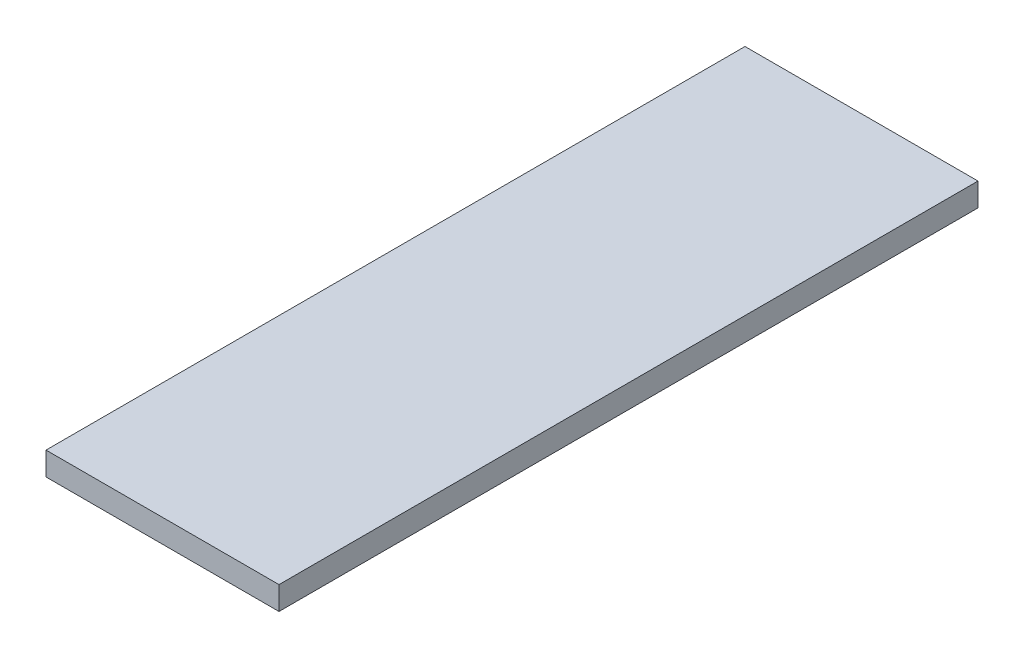
ISO-10303-21;
HEADER;
FILE_DESCRIPTION(('STEP AP214'),'2;1');
FILE_NAME('part.step','',(''),(''),'','','');
FILE_SCHEMA(('AUTOMOTIVE_DESIGN { 1 0 10303 214 1 1 1 1 }'));
ENDSEC;
DATA;
#1=APPLICATION_CONTEXT('core data for automotive mechanical design processes');
#2=APPLICATION_PROTOCOL_DEFINITION('international standard','automotive_design',2000,#1);
#3=PRODUCT_CONTEXT('',#1,'mechanical');
#4=PRODUCT('Part','Part','',(#3));
#5=PRODUCT_RELATED_PRODUCT_CATEGORY('part','',(#4));
#6=PRODUCT_DEFINITION_FORMATION('','',#4);
#7=PRODUCT_DEFINITION_CONTEXT('part definition',#1,'design');
#8=PRODUCT_DEFINITION('design','',#6,#7);
#9=PRODUCT_DEFINITION_SHAPE('','',#8);
#10=(LENGTH_UNIT() NAMED_UNIT(*) SI_UNIT(.MILLI.,.METRE.));
#11=(NAMED_UNIT(*) PLANE_ANGLE_UNIT() SI_UNIT($,.RADIAN.));
#12=(NAMED_UNIT(*) SI_UNIT($,.STERADIAN.) SOLID_ANGLE_UNIT());
#13=UNCERTAINTY_MEASURE_WITH_UNIT(LENGTH_MEASURE(1.E-05),#10,'distance_accuracy_value','');
#14=(GEOMETRIC_REPRESENTATION_CONTEXT(3) GLOBAL_UNCERTAINTY_ASSIGNED_CONTEXT((#13)) GLOBAL_UNIT_ASSIGNED_CONTEXT((#10,
#11,#12)) REPRESENTATION_CONTEXT('',''));
#15=CARTESIAN_POINT('',(0.,0.,0.));
#16=DIRECTION('',(0.,0.,1.));
#17=DIRECTION('',(1.,0.,0.));
#18=AXIS2_PLACEMENT_3D('',#15,#16,#17);
#19=CARTESIAN_POINT('',(-6.,1.2,-18.));
#20=DIRECTION('',(1.,0.,0.));
#21=DIRECTION('',(0.,0.,-1.));
#22=AXIS2_PLACEMENT_3D('',#19,#20,#21);
#23=PLANE('',#22);
#24=DIRECTION('',(0.,0.,1.));
#25=VECTOR('',#24,1.);
#26=CARTESIAN_POINT('',(-6.,0.,-18.));
#27=LINE('',#26,#25);
#28=CARTESIAN_POINT('',(-6.,0.,-18.));
#29=VERTEX_POINT('',#28);
#30=CARTESIAN_POINT('',(-5.99999999999999,0.,18.));
#31=VERTEX_POINT('',#30);
#32=EDGE_CURVE('E96',#29,#31,#27,.T.);
#33=ORIENTED_EDGE('',*,*,#32,.T.);
#34=DIRECTION('',(0.,-1.,0.));
#35=VECTOR('',#34,1.);
#36=CARTESIAN_POINT('',(-5.99999999999999,1.2,18.));
#37=LINE('',#36,#35);
#38=CARTESIAN_POINT('',(-5.99999999999999,1.2,18.));
#39=VERTEX_POINT('',#38);
#40=EDGE_CURVE('E11',#39,#31,#37,.T.);
#41=ORIENTED_EDGE('',*,*,#40,.F.);
#42=DIRECTION('',(0.,0.,1.));
#43=VECTOR('',#42,1.);
#44=CARTESIAN_POINT('',(-6.,1.2,-18.));
#45=LINE('',#44,#43);
#46=CARTESIAN_POINT('',(-6.,1.2,-18.));
#47=VERTEX_POINT('',#46);
#48=EDGE_CURVE('E84',#47,#39,#45,.T.);
#49=ORIENTED_EDGE('',*,*,#48,.F.);
#50=DIRECTION('',(0.,-1.,0.));
#51=VECTOR('',#50,1.);
#52=CARTESIAN_POINT('',(-6.,1.2,-18.));
#53=LINE('',#52,#51);
#54=EDGE_CURVE('E92',#47,#29,#53,.T.);
#55=ORIENTED_EDGE('',*,*,#54,.T.);
#56=EDGE_LOOP('',(#33,#41,#49,#55));
#57=FACE_BOUND('',#56,.T.);
#58=ADVANCED_FACE('F33',(#57),#23,.F.);
#59=CARTESIAN_POINT('',(-5.99999999999999,1.2,18.));
#60=DIRECTION('',(0.,0.,-1.));
#61=DIRECTION('',(-1.,0.,0.));
#62=AXIS2_PLACEMENT_3D('',#59,#60,#61);
#63=PLANE('',#62);
#64=DIRECTION('',(1.,0.,0.));
#65=VECTOR('',#64,1.);
#66=CARTESIAN_POINT('',(-5.99999999999999,0.,18.));
#67=LINE('',#66,#65);
#68=CARTESIAN_POINT('',(6.00000000000001,0.,18.));
#69=VERTEX_POINT('',#68);
#70=EDGE_CURVE('E88',#31,#69,#67,.T.);
#71=ORIENTED_EDGE('',*,*,#70,.T.);
#72=DIRECTION('',(0.,-1.,0.));
#73=VECTOR('',#72,1.);
#74=CARTESIAN_POINT('',(6.00000000000001,1.2,18.));
#75=LINE('',#74,#73);
#76=CARTESIAN_POINT('',(6.00000000000001,1.2,18.));
#77=VERTEX_POINT('',#76);
#78=EDGE_CURVE('E41',#77,#69,#75,.T.);
#79=ORIENTED_EDGE('',*,*,#78,.F.);
#80=DIRECTION('',(1.,0.,0.));
#81=VECTOR('',#80,1.);
#82=CARTESIAN_POINT('',(-5.99999999999999,1.2,18.));
#83=LINE('',#82,#81);
#84=EDGE_CURVE('E79',#39,#77,#83,.T.);
#85=ORIENTED_EDGE('',*,*,#84,.F.);
#86=ORIENTED_EDGE('',*,*,#40,.T.);
#87=EDGE_LOOP('',(#71,#79,#85,#86));
#88=FACE_BOUND('',#87,.T.);
#89=ADVANCED_FACE('F87',(#88),#63,.F.);
#90=CARTESIAN_POINT('',(6.,1.2,-18.));
#91=DIRECTION('',(-1.,0.,0.));
#92=DIRECTION('',(0.,0.,1.));
#93=AXIS2_PLACEMENT_3D('',#90,#91,#92);
#94=PLANE('',#93);
#95=DIRECTION('',(0.,0.,-1.));
#96=VECTOR('',#95,1.);
#97=CARTESIAN_POINT('',(6.,0.,-18.));
#98=LINE('',#97,#96);
#99=CARTESIAN_POINT('',(6.,0.,-18.));
#100=VERTEX_POINT('',#99);
#101=EDGE_CURVE('E66',#69,#100,#98,.T.);
#102=ORIENTED_EDGE('',*,*,#101,.T.);
#103=DIRECTION('',(0.,-1.,0.));
#104=VECTOR('',#103,1.);
#105=CARTESIAN_POINT('',(6.,1.2,-18.));
#106=LINE('',#105,#104);
#107=CARTESIAN_POINT('',(6.,1.2,-18.));
#108=VERTEX_POINT('',#107);
#109=EDGE_CURVE('E89',#108,#100,#106,.T.);
#110=ORIENTED_EDGE('',*,*,#109,.F.);
#111=DIRECTION('',(0.,0.,-1.));
#112=VECTOR('',#111,1.);
#113=CARTESIAN_POINT('',(6.,1.2,-18.));
#114=LINE('',#113,#112);
#115=EDGE_CURVE('E82',#77,#108,#114,.T.);
#116=ORIENTED_EDGE('',*,*,#115,.F.);
#117=ORIENTED_EDGE('',*,*,#78,.T.);
#118=EDGE_LOOP('',(#102,#110,#116,#117));
#119=FACE_BOUND('',#118,.T.);
#120=ADVANCED_FACE('F90',(#119),#94,.F.);
#121=CARTESIAN_POINT('',(-6.,1.2,-18.));
#122=DIRECTION('',(0.,0.,1.));
#123=DIRECTION('',(1.,0.,0.));
#124=AXIS2_PLACEMENT_3D('',#121,#122,#123);
#125=PLANE('',#124);
#126=DIRECTION('',(-1.,0.,0.));
#127=VECTOR('',#126,1.);
#128=CARTESIAN_POINT('',(-6.,0.,-18.));
#129=LINE('',#128,#127);
#130=EDGE_CURVE('E72',#100,#29,#129,.T.);
#131=ORIENTED_EDGE('',*,*,#130,.T.);
#132=ORIENTED_EDGE('',*,*,#54,.F.);
#133=DIRECTION('',(-1.,0.,0.));
#134=VECTOR('',#133,1.);
#135=CARTESIAN_POINT('',(-6.,1.2,-18.));
#136=LINE('',#135,#134);
#137=EDGE_CURVE('E49',#108,#47,#136,.T.);
#138=ORIENTED_EDGE('',*,*,#137,.F.);
#139=ORIENTED_EDGE('',*,*,#109,.T.);
#140=EDGE_LOOP('',(#131,#132,#138,#139));
#141=FACE_BOUND('',#140,.T.);
#142=ADVANCED_FACE('F103',(#141),#125,.F.);
#143=CARTESIAN_POINT('',(0.,1.2,0.));
#144=DIRECTION('',(0.,1.,0.));
#145=DIRECTION('',(0.,0.,1.));
#146=AXIS2_PLACEMENT_3D('',#143,#144,#145);
#147=PLANE('',#146);
#148=ORIENTED_EDGE('',*,*,#48,.T.);
#149=ORIENTED_EDGE('',*,*,#84,.T.);
#150=ORIENTED_EDGE('',*,*,#115,.T.);
#151=ORIENTED_EDGE('',*,*,#137,.T.);
#152=EDGE_LOOP('',(#148,#149,#150,#151));
#153=FACE_BOUND('',#152,.T.);
#154=ADVANCED_FACE('F80',(#153),#147,.T.);
#155=CARTESIAN_POINT('',(0.,0.,0.));
#156=DIRECTION('',(0.,1.,0.));
#157=DIRECTION('',(0.,0.,1.));
#158=AXIS2_PLACEMENT_3D('',#155,#156,#157);
#159=PLANE('',#158);
#160=ORIENTED_EDGE('',*,*,#32,.F.);
#161=ORIENTED_EDGE('',*,*,#130,.F.);
#162=ORIENTED_EDGE('',*,*,#101,.F.);
#163=ORIENTED_EDGE('',*,*,#70,.F.);
#164=EDGE_LOOP('',(#160,#161,#162,#163));
#165=FACE_BOUND('',#164,.T.);
#166=ADVANCED_FACE('F106',(#165),#159,.F.);
#167=CLOSED_SHELL('',(#58,#89,#120,#142,#154,#166));
#168=MANIFOLD_SOLID_BREP('B2',#167);
#169=ADVANCED_BREP_SHAPE_REPRESENTATION('',(#18,#168),#14);
#170=SHAPE_DEFINITION_REPRESENTATION(#9,#169);
ENDSEC;
END-ISO-10303-21;
